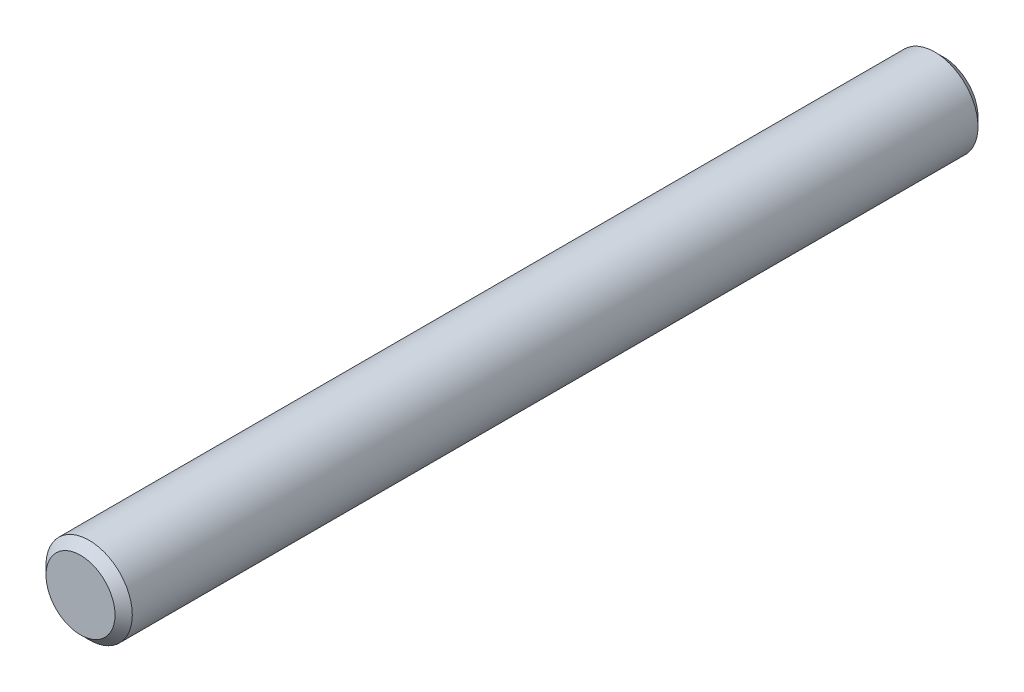
ISO-10303-21;
HEADER;
FILE_DESCRIPTION(('STEP AP214'),'2;1');
FILE_NAME('part.step','',(''),(''),'','','');
FILE_SCHEMA(('AUTOMOTIVE_DESIGN { 1 0 10303 214 1 1 1 1 }'));
ENDSEC;
DATA;
#1=APPLICATION_CONTEXT('core data for automotive mechanical design processes');
#2=APPLICATION_PROTOCOL_DEFINITION('international standard','automotive_design',2000,#1);
#3=PRODUCT_CONTEXT('',#1,'mechanical');
#4=PRODUCT('Part','Part','',(#3));
#5=PRODUCT_RELATED_PRODUCT_CATEGORY('part','',(#4));
#6=PRODUCT_DEFINITION_FORMATION('','',#4);
#7=PRODUCT_DEFINITION_CONTEXT('part definition',#1,'design');
#8=PRODUCT_DEFINITION('design','',#6,#7);
#9=PRODUCT_DEFINITION_SHAPE('','',#8);
#10=(LENGTH_UNIT() NAMED_UNIT(*) SI_UNIT(.MILLI.,.METRE.));
#11=(NAMED_UNIT(*) PLANE_ANGLE_UNIT() SI_UNIT($,.RADIAN.));
#12=(NAMED_UNIT(*) SI_UNIT($,.STERADIAN.) SOLID_ANGLE_UNIT());
#13=UNCERTAINTY_MEASURE_WITH_UNIT(LENGTH_MEASURE(1.E-05),#10,'distance_accuracy_value','');
#14=(GEOMETRIC_REPRESENTATION_CONTEXT(3) GLOBAL_UNCERTAINTY_ASSIGNED_CONTEXT((#13)) GLOBAL_UNIT_ASSIGNED_CONTEXT((#10,
#11,#12)) REPRESENTATION_CONTEXT('',''));
#15=CARTESIAN_POINT('',(0.,0.,0.));
#16=DIRECTION('',(0.,0.,1.));
#17=DIRECTION('',(1.,0.,0.));
#18=AXIS2_PLACEMENT_3D('',#15,#16,#17);
#19=CARTESIAN_POINT('',(0.,0.,10.));
#20=DIRECTION('',(0.,0.,-1.));
#21=DIRECTION('',(-1.,0.,0.));
#22=AXIS2_PLACEMENT_3D('',#19,#20,#21);
#23=CYLINDRICAL_SURFACE('',#22,1.);
#24=CARTESIAN_POINT('',(0.,0.,-9.8));
#25=DIRECTION('',(0.,0.,1.));
#26=DIRECTION('',(1.,0.,0.));
#27=AXIS2_PLACEMENT_3D('',#24,#25,#26);
#28=CIRCLE('',#27,1.);
#29=CARTESIAN_POINT('',(1.,0.,-9.8));
#30=VERTEX_POINT('',#29);
#31=EDGE_CURVE('E44',#30,#30,#28,.T.);
#32=ORIENTED_EDGE('',*,*,#31,.T.);
#33=EDGE_LOOP('',(#32));
#34=FACE_BOUND('',#33,.T.);
#35=CARTESIAN_POINT('',(0.,0.,9.8));
#36=DIRECTION('',(0.,0.,1.));
#37=DIRECTION('',(1.,0.,0.));
#38=AXIS2_PLACEMENT_3D('',#35,#36,#37);
#39=CIRCLE('',#38,1.);
#40=CARTESIAN_POINT('',(1.,0.,9.8));
#41=VERTEX_POINT('',#40);
#42=EDGE_CURVE('E48',#41,#41,#39,.F.);
#43=ORIENTED_EDGE('',*,*,#42,.T.);
#44=EDGE_LOOP('',(#43));
#45=FACE_BOUND('',#44,.T.);
#46=ADVANCED_FACE('F32',(#34,#45),#23,.T.);
#47=CARTESIAN_POINT('',(0.,0.,10.));
#48=DIRECTION('',(0.,0.,1.));
#49=DIRECTION('',(1.,0.,0.));
#50=AXIS2_PLACEMENT_3D('',#47,#48,#49);
#51=PLANE('',#50);
#52=CARTESIAN_POINT('',(0.,0.,10.));
#53=DIRECTION('',(0.,0.,1.));
#54=DIRECTION('',(1.,0.,0.));
#55=AXIS2_PLACEMENT_3D('',#52,#53,#54);
#56=CIRCLE('',#55,0.799999999999997);
#57=CARTESIAN_POINT('',(0.799999999999997,0.,10.));
#58=VERTEX_POINT('',#57);
#59=EDGE_CURVE('E10',#58,#58,#56,.T.);
#60=ORIENTED_EDGE('',*,*,#59,.T.);
#61=EDGE_LOOP('',(#60));
#62=FACE_BOUND('',#61,.T.);
#63=ADVANCED_FACE('F64',(#62),#51,.T.);
#64=CARTESIAN_POINT('',(0.,0.,-10.));
#65=DIRECTION('',(0.,0.,1.));
#66=DIRECTION('',(1.,0.,0.));
#67=AXIS2_PLACEMENT_3D('',#64,#65,#66);
#68=PLANE('',#67);
#69=CARTESIAN_POINT('',(0.,0.,-10.));
#70=DIRECTION('',(0.,0.,1.));
#71=DIRECTION('',(1.,0.,0.));
#72=AXIS2_PLACEMENT_3D('',#69,#70,#71);
#73=CIRCLE('',#72,0.800000000000002);
#74=CARTESIAN_POINT('',(0.800000000000002,0.,-10.));
#75=VERTEX_POINT('',#74);
#76=EDGE_CURVE('E40',#75,#75,#73,.F.);
#77=ORIENTED_EDGE('',*,*,#76,.T.);
#78=EDGE_LOOP('',(#77));
#79=FACE_BOUND('',#78,.T.);
#80=ADVANCED_FACE('F61',(#79),#68,.F.);
#81=CARTESIAN_POINT('',(0.,0.,-9.8));
#82=DIRECTION('',(0.,0.,1.));
#83=DIRECTION('',(1.,0.,0.));
#84=AXIS2_PLACEMENT_3D('',#81,#82,#83);
#85=CONICAL_SURFACE('',#84,1.,0.785398163397438);
#86=ORIENTED_EDGE('',*,*,#76,.F.);
#87=EDGE_LOOP('',(#86));
#88=FACE_BOUND('',#87,.T.);
#89=ORIENTED_EDGE('',*,*,#31,.F.);
#90=EDGE_LOOP('',(#89));
#91=FACE_BOUND('',#90,.T.);
#92=ADVANCED_FACE('F57',(#88,#91),#85,.T.);
#93=CARTESIAN_POINT('',(0.,0.,10.));
#94=DIRECTION('',(0.,0.,-1.));
#95=DIRECTION('',(-1.,0.,0.));
#96=AXIS2_PLACEMENT_3D('',#93,#94,#95);
#97=CONICAL_SURFACE('',#96,0.799999999999997,0.78539816339745);
#98=ORIENTED_EDGE('',*,*,#42,.F.);
#99=EDGE_LOOP('',(#98));
#100=FACE_BOUND('',#99,.T.);
#101=ORIENTED_EDGE('',*,*,#59,.F.);
#102=EDGE_LOOP('',(#101));
#103=FACE_BOUND('',#102,.T.);
#104=ADVANCED_FACE('F35',(#100,#103),#97,.T.);
#105=CLOSED_SHELL('',(#46,#63,#80,#92,#104));
#106=MANIFOLD_SOLID_BREP('B2',#105);
#107=ADVANCED_BREP_SHAPE_REPRESENTATION('',(#18,#106),#14);
#108=SHAPE_DEFINITION_REPRESENTATION(#9,#107);
ENDSEC;
END-ISO-10303-21;
